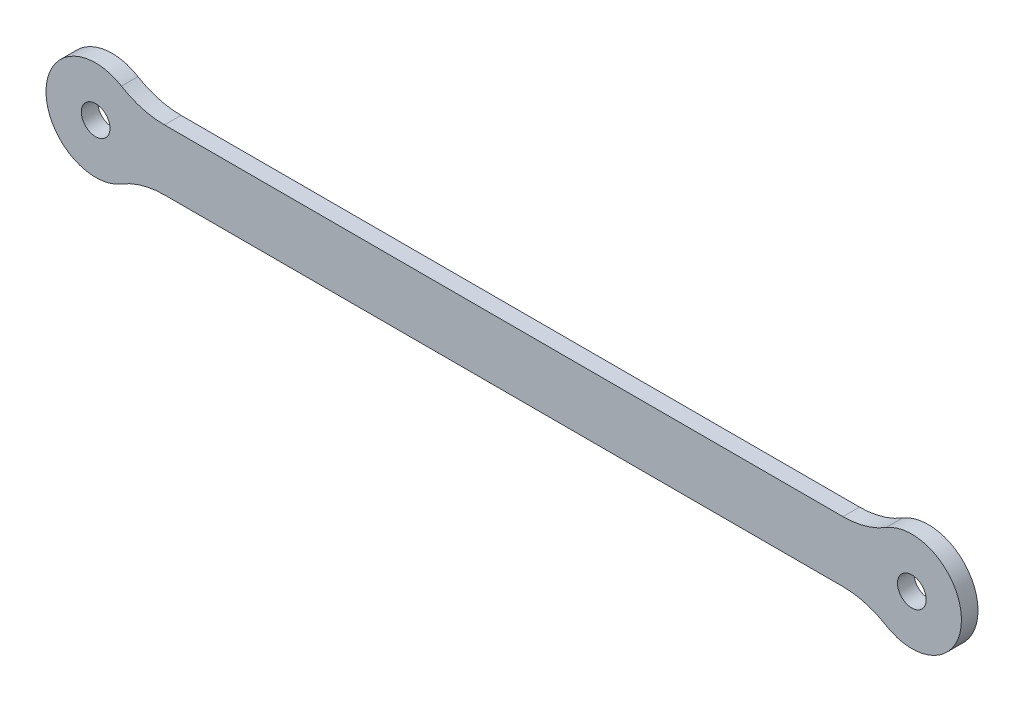
ISO-10303-21;
HEADER;
FILE_DESCRIPTION(('STEP AP214'),'2;1');
FILE_NAME('part.step','',(''),(''),'','','');
FILE_SCHEMA(('AUTOMOTIVE_DESIGN { 1 0 10303 214 1 1 1 1 }'));
ENDSEC;
DATA;
#1=APPLICATION_CONTEXT('core data for automotive mechanical design processes');
#2=APPLICATION_PROTOCOL_DEFINITION('international standard','automotive_design',2000,#1);
#3=PRODUCT_CONTEXT('',#1,'mechanical');
#4=PRODUCT('Part','Part','',(#3));
#5=PRODUCT_RELATED_PRODUCT_CATEGORY('part','',(#4));
#6=PRODUCT_DEFINITION_FORMATION('','',#4);
#7=PRODUCT_DEFINITION_CONTEXT('part definition',#1,'design');
#8=PRODUCT_DEFINITION('design','',#6,#7);
#9=PRODUCT_DEFINITION_SHAPE('','',#8);
#10=(LENGTH_UNIT() NAMED_UNIT(*) SI_UNIT(.MILLI.,.METRE.));
#11=(NAMED_UNIT(*) PLANE_ANGLE_UNIT() SI_UNIT($,.RADIAN.));
#12=(NAMED_UNIT(*) SI_UNIT($,.STERADIAN.) SOLID_ANGLE_UNIT());
#13=UNCERTAINTY_MEASURE_WITH_UNIT(LENGTH_MEASURE(1.E-05),#10,'distance_accuracy_value','');
#14=(GEOMETRIC_REPRESENTATION_CONTEXT(3) GLOBAL_UNCERTAINTY_ASSIGNED_CONTEXT((#13)) GLOBAL_UNIT_ASSIGNED_CONTEXT((#10,
#11,#12)) REPRESENTATION_CONTEXT('',''));
#15=CARTESIAN_POINT('',(0.,0.,0.));
#16=DIRECTION('',(0.,0.,1.));
#17=DIRECTION('',(1.,0.,0.));
#18=AXIS2_PLACEMENT_3D('',#15,#16,#17);
#19=CARTESIAN_POINT('',(-148.,0.,0.));
#20=DIRECTION('',(0.,0.,1.));
#21=DIRECTION('',(1.,0.,0.));
#22=AXIS2_PLACEMENT_3D('',#19,#20,#21);
#23=PLANE('',#22);
#24=CARTESIAN_POINT('',(-12.4799839743487,20.5,0.));
#25=DIRECTION('',(0.,0.,-1.));
#26=DIRECTION('',(-1.,0.,0.));
#27=AXIS2_PLACEMENT_3D('',#24,#25,#26);
#28=CIRCLE('',#27,15.);
#29=CARTESIAN_POINT('',(-12.4799839743487,5.49999999999998,0.));
#30=VERTEX_POINT('',#29);
#31=CARTESIAN_POINT('',(-4.67999399038076,7.68749999999999,0.));
#32=VERTEX_POINT('',#31);
#33=EDGE_CURVE('E43',#30,#32,#28,.F.);
#34=ORIENTED_EDGE('',*,*,#33,.T.);
#35=CARTESIAN_POINT('',(0.,0.,0.));
#36=DIRECTION('',(0.,0.,-1.));
#37=DIRECTION('',(-1.,0.,0.));
#38=AXIS2_PLACEMENT_3D('',#35,#36,#37);
#39=CIRCLE('',#38,9.);
#40=CARTESIAN_POINT('',(-4.67999399038075,-7.68750000000001,0.));
#41=VERTEX_POINT('',#40);
#42=EDGE_CURVE('E123',#41,#32,#39,.F.);
#43=ORIENTED_EDGE('',*,*,#42,.F.);
#44=CARTESIAN_POINT('',(-12.4799839743487,-20.5,0.));
#45=DIRECTION('',(0.,0.,-1.));
#46=DIRECTION('',(-1.,0.,0.));
#47=AXIS2_PLACEMENT_3D('',#44,#45,#46);
#48=CIRCLE('',#47,15.);
#49=CARTESIAN_POINT('',(-12.4799839743487,-5.50000000000002,0.));
#50=VERTEX_POINT('',#49);
#51=EDGE_CURVE('E133',#41,#50,#48,.F.);
#52=ORIENTED_EDGE('',*,*,#51,.T.);
#53=DIRECTION('',(1.,0.,0.));
#54=VECTOR('',#53,1.);
#55=CARTESIAN_POINT('',(-140.876096575612,-5.50000000000002,0.));
#56=LINE('',#55,#54);
#57=CARTESIAN_POINT('',(-135.520016025651,-5.50000000000002,0.));
#58=VERTEX_POINT('',#57);
#59=EDGE_CURVE('E137',#50,#58,#56,.F.);
#60=ORIENTED_EDGE('',*,*,#59,.T.);
#61=CARTESIAN_POINT('',(-135.520016025651,-20.5,0.));
#62=DIRECTION('',(0.,0.,-1.));
#63=DIRECTION('',(-1.,0.,0.));
#64=AXIS2_PLACEMENT_3D('',#61,#62,#63);
#65=CIRCLE('',#64,15.);
#66=CARTESIAN_POINT('',(-143.320006009619,-7.68750000000003,0.));
#67=VERTEX_POINT('',#66);
#68=EDGE_CURVE('E141',#58,#67,#65,.F.);
#69=ORIENTED_EDGE('',*,*,#68,.T.);
#70=CARTESIAN_POINT('',(-148.,0.,0.));
#71=DIRECTION('',(0.,0.,-1.));
#72=DIRECTION('',(-1.,0.,0.));
#73=AXIS2_PLACEMENT_3D('',#70,#71,#72);
#74=CIRCLE('',#73,9.00000000000001);
#75=CARTESIAN_POINT('',(-143.320006009619,7.68749999999998,0.));
#76=VERTEX_POINT('',#75);
#77=EDGE_CURVE('E144',#76,#67,#74,.F.);
#78=ORIENTED_EDGE('',*,*,#77,.F.);
#79=CARTESIAN_POINT('',(-135.520016025651,20.5,0.));
#80=DIRECTION('',(0.,0.,-1.));
#81=DIRECTION('',(-1.,0.,0.));
#82=AXIS2_PLACEMENT_3D('',#79,#80,#81);
#83=CIRCLE('',#82,15.);
#84=CARTESIAN_POINT('',(-135.520016025651,5.49999999999997,0.));
#85=VERTEX_POINT('',#84);
#86=EDGE_CURVE('E38',#76,#85,#83,.F.);
#87=ORIENTED_EDGE('',*,*,#86,.T.);
#88=DIRECTION('',(1.,0.,0.));
#89=VECTOR('',#88,1.);
#90=CARTESIAN_POINT('',(-140.876096575612,5.49999999999998,0.));
#91=LINE('',#90,#89);
#92=EDGE_CURVE('E119',#85,#30,#91,.T.);
#93=ORIENTED_EDGE('',*,*,#92,.T.);
#94=EDGE_LOOP('',(#34,#43,#52,#60,#69,#78,#87,#93));
#95=FACE_BOUND('',#94,.T.);
#96=CARTESIAN_POINT('',(-148.,0.,0.));
#97=DIRECTION('',(0.,0.,1.));
#98=DIRECTION('',(1.,0.,0.));
#99=AXIS2_PLACEMENT_3D('',#96,#97,#98);
#100=CIRCLE('',#99,2.59999999999999);
#101=CARTESIAN_POINT('',(-145.4,0.,0.));
#102=VERTEX_POINT('',#101);
#103=EDGE_CURVE('E111',#102,#102,#100,.T.);
#104=ORIENTED_EDGE('',*,*,#103,.T.);
#105=EDGE_LOOP('',(#104));
#106=FACE_BOUND('',#105,.T.);
#107=CARTESIAN_POINT('',(0.,0.,0.));
#108=DIRECTION('',(0.,0.,1.));
#109=DIRECTION('',(1.,0.,0.));
#110=AXIS2_PLACEMENT_3D('',#107,#108,#109);
#111=CIRCLE('',#110,2.6);
#112=CARTESIAN_POINT('',(2.6,0.,0.));
#113=VERTEX_POINT('',#112);
#114=EDGE_CURVE('E293',#113,#113,#111,.T.);
#115=ORIENTED_EDGE('',*,*,#114,.T.);
#116=EDGE_LOOP('',(#115));
#117=FACE_BOUND('',#116,.T.);
#118=ADVANCED_FACE('F35',(#95,#106,#117),#23,.F.);
#119=CARTESIAN_POINT('',(-140.876096575612,5.49999999999998,5.));
#120=DIRECTION('',(0.,-1.,0.));
#121=DIRECTION('',(0.,0.,-1.));
#122=AXIS2_PLACEMENT_3D('',#119,#120,#121);
#123=PLANE('',#122);
#124=DIRECTION('',(0.,0.,-1.));
#125=VECTOR('',#124,1.);
#126=CARTESIAN_POINT('',(-135.520016025651,5.49999999999997,5.));
#127=LINE('',#126,#125);
#128=CARTESIAN_POINT('',(-135.520016025651,5.49999999999996,3.));
#129=VERTEX_POINT('',#128);
#130=EDGE_CURVE('E118',#85,#129,#127,.F.);
#131=ORIENTED_EDGE('',*,*,#130,.T.);
#132=DIRECTION('',(1.,0.,0.));
#133=VECTOR('',#132,1.);
#134=CARTESIAN_POINT('',(-140.876096575612,5.49999999999998,3.));
#135=LINE('',#134,#133);
#136=CARTESIAN_POINT('',(-12.4799839743487,5.49999999999998,3.));
#137=VERTEX_POINT('',#136);
#138=EDGE_CURVE('E89',#129,#137,#135,.T.);
#139=ORIENTED_EDGE('',*,*,#138,.T.);
#140=DIRECTION('',(0.,0.,-1.));
#141=VECTOR('',#140,1.);
#142=CARTESIAN_POINT('',(-12.4799839743487,5.49999999999998,5.));
#143=LINE('',#142,#141);
#144=EDGE_CURVE('E116',#137,#30,#143,.T.);
#145=ORIENTED_EDGE('',*,*,#144,.T.);
#146=ORIENTED_EDGE('',*,*,#92,.F.);
#147=EDGE_LOOP('',(#131,#139,#145,#146));
#148=FACE_BOUND('',#147,.T.);
#149=ADVANCED_FACE('F115',(#148),#123,.F.);
#150=CARTESIAN_POINT('',(-135.520016025651,20.5,5.));
#151=DIRECTION('',(0.,0.,-1.));
#152=DIRECTION('',(-1.,0.,0.));
#153=AXIS2_PLACEMENT_3D('',#150,#151,#152);
#154=CYLINDRICAL_SURFACE('',#153,15.);
#155=DIRECTION('',(0.,0.,-1.));
#156=VECTOR('',#155,1.);
#157=CARTESIAN_POINT('',(-143.320006009619,7.68749999999998,5.));
#158=LINE('',#157,#156);
#159=CARTESIAN_POINT('',(-143.320006009619,7.68749999999998,3.));
#160=VERTEX_POINT('',#159);
#161=EDGE_CURVE('E142',#160,#76,#158,.T.);
#162=ORIENTED_EDGE('',*,*,#161,.F.);
#163=CARTESIAN_POINT('',(-135.520016025651,20.5,3.));
#164=DIRECTION('',(0.,0.,-1.));
#165=DIRECTION('',(-1.,0.,0.));
#166=AXIS2_PLACEMENT_3D('',#163,#164,#165);
#167=CIRCLE('',#166,15.);
#168=EDGE_CURVE('E120',#160,#129,#167,.F.);
#169=ORIENTED_EDGE('',*,*,#168,.T.);
#170=ORIENTED_EDGE('',*,*,#130,.F.);
#171=ORIENTED_EDGE('',*,*,#86,.F.);
#172=EDGE_LOOP('',(#162,#169,#170,#171));
#173=FACE_BOUND('',#172,.T.);
#174=ADVANCED_FACE('F171',(#173),#154,.F.);
#175=CARTESIAN_POINT('',(-148.,0.,5.));
#176=DIRECTION('',(0.,0.,-1.));
#177=DIRECTION('',(-1.,0.,0.));
#178=AXIS2_PLACEMENT_3D('',#175,#176,#177);
#179=CYLINDRICAL_SURFACE('',#178,9.00000000000001);
#180=CARTESIAN_POINT('',(-148.,0.,3.));
#181=DIRECTION('',(0.,0.,-1.));
#182=DIRECTION('',(-1.,0.,0.));
#183=AXIS2_PLACEMENT_3D('',#180,#181,#182);
#184=CIRCLE('',#183,9.00000000000001);
#185=CARTESIAN_POINT('',(-143.320006009619,-7.68750000000002,3.));
#186=VERTEX_POINT('',#185);
#187=EDGE_CURVE('E162',#160,#186,#184,.F.);
#188=ORIENTED_EDGE('',*,*,#187,.F.);
#189=ORIENTED_EDGE('',*,*,#161,.T.);
#190=ORIENTED_EDGE('',*,*,#77,.T.);
#191=DIRECTION('',(0.,0.,-1.));
#192=VECTOR('',#191,1.);
#193=CARTESIAN_POINT('',(-143.320006009619,-7.68750000000003,5.));
#194=LINE('',#193,#192);
#195=EDGE_CURVE('E138',#67,#186,#194,.F.);
#196=ORIENTED_EDGE('',*,*,#195,.T.);
#197=EDGE_LOOP('',(#188,#189,#190,#196));
#198=FACE_BOUND('',#197,.T.);
#199=ADVANCED_FACE('F153',(#198),#179,.T.);
#200=CARTESIAN_POINT('',(-135.520016025651,-20.5,5.));
#201=DIRECTION('',(0.,0.,-1.));
#202=DIRECTION('',(-1.,0.,0.));
#203=AXIS2_PLACEMENT_3D('',#200,#201,#202);
#204=CYLINDRICAL_SURFACE('',#203,15.);
#205=DIRECTION('',(0.,0.,1.));
#206=VECTOR('',#205,1.);
#207=CARTESIAN_POINT('',(-135.520016025651,-5.50000000000002,5.));
#208=LINE('',#207,#206);
#209=CARTESIAN_POINT('',(-135.520016025651,-5.50000000000002,3.));
#210=VERTEX_POINT('',#209);
#211=EDGE_CURVE('E134',#58,#210,#208,.T.);
#212=ORIENTED_EDGE('',*,*,#211,.T.);
#213=CARTESIAN_POINT('',(-135.520016025651,-20.5,3.));
#214=DIRECTION('',(0.,0.,-1.));
#215=DIRECTION('',(-1.,0.,0.));
#216=AXIS2_PLACEMENT_3D('',#213,#214,#215);
#217=CIRCLE('',#216,15.);
#218=EDGE_CURVE('E160',#210,#186,#217,.F.);
#219=ORIENTED_EDGE('',*,*,#218,.T.);
#220=ORIENTED_EDGE('',*,*,#195,.F.);
#221=ORIENTED_EDGE('',*,*,#68,.F.);
#222=EDGE_LOOP('',(#212,#219,#220,#221));
#223=FACE_BOUND('',#222,.T.);
#224=ADVANCED_FACE('F158',(#223),#204,.F.);
#225=CARTESIAN_POINT('',(-140.876096575612,-5.50000000000002,5.));
#226=DIRECTION('',(0.,1.,0.));
#227=DIRECTION('',(0.,0.,1.));
#228=AXIS2_PLACEMENT_3D('',#225,#226,#227);
#229=PLANE('',#228);
#230=DIRECTION('',(0.,0.,-1.));
#231=VECTOR('',#230,1.);
#232=CARTESIAN_POINT('',(-12.4799839743487,-5.50000000000002,5.));
#233=LINE('',#232,#231);
#234=CARTESIAN_POINT('',(-12.4799839743487,-5.50000000000001,3.));
#235=VERTEX_POINT('',#234);
#236=EDGE_CURVE('E130',#50,#235,#233,.F.);
#237=ORIENTED_EDGE('',*,*,#236,.T.);
#238=DIRECTION('',(-1.,0.,0.));
#239=VECTOR('',#238,1.);
#240=CARTESIAN_POINT('',(-140.876096575612,-5.50000000000002,3.));
#241=LINE('',#240,#239);
#242=EDGE_CURVE('E163',#235,#210,#241,.T.);
#243=ORIENTED_EDGE('',*,*,#242,.T.);
#244=ORIENTED_EDGE('',*,*,#211,.F.);
#245=ORIENTED_EDGE('',*,*,#59,.F.);
#246=EDGE_LOOP('',(#237,#243,#244,#245));
#247=FACE_BOUND('',#246,.T.);
#248=ADVANCED_FACE('F196',(#247),#229,.F.);
#249=CARTESIAN_POINT('',(-12.4799839743487,-20.5,5.));
#250=DIRECTION('',(0.,0.,-1.));
#251=DIRECTION('',(-1.,0.,0.));
#252=AXIS2_PLACEMENT_3D('',#249,#250,#251);
#253=CYLINDRICAL_SURFACE('',#252,15.);
#254=DIRECTION('',(0.,0.,-1.));
#255=VECTOR('',#254,1.);
#256=CARTESIAN_POINT('',(-4.67999399038075,-7.68750000000001,5.));
#257=LINE('',#256,#255);
#258=CARTESIAN_POINT('',(-4.67999399038075,-7.68750000000001,3.));
#259=VERTEX_POINT('',#258);
#260=EDGE_CURVE('E126',#259,#41,#257,.T.);
#261=ORIENTED_EDGE('',*,*,#260,.F.);
#262=CARTESIAN_POINT('',(-12.4799839743487,-20.5,3.));
#263=DIRECTION('',(0.,0.,-1.));
#264=DIRECTION('',(-1.,0.,0.));
#265=AXIS2_PLACEMENT_3D('',#262,#263,#264);
#266=CIRCLE('',#265,15.);
#267=EDGE_CURVE('E166',#259,#235,#266,.F.);
#268=ORIENTED_EDGE('',*,*,#267,.T.);
#269=ORIENTED_EDGE('',*,*,#236,.F.);
#270=ORIENTED_EDGE('',*,*,#51,.F.);
#271=EDGE_LOOP('',(#261,#268,#269,#270));
#272=FACE_BOUND('',#271,.T.);
#273=ADVANCED_FACE('F189',(#272),#253,.F.);
#274=CARTESIAN_POINT('',(0.,0.,5.));
#275=DIRECTION('',(0.,0.,-1.));
#276=DIRECTION('',(-1.,0.,0.));
#277=AXIS2_PLACEMENT_3D('',#274,#275,#276);
#278=CYLINDRICAL_SURFACE('',#277,9.);
#279=CARTESIAN_POINT('',(0.,0.,3.));
#280=DIRECTION('',(0.,0.,-1.));
#281=DIRECTION('',(-1.,0.,0.));
#282=AXIS2_PLACEMENT_3D('',#279,#280,#281);
#283=CIRCLE('',#282,9.);
#284=CARTESIAN_POINT('',(-4.67999399038076,7.6875,3.));
#285=VERTEX_POINT('',#284);
#286=EDGE_CURVE('E51',#259,#285,#283,.F.);
#287=ORIENTED_EDGE('',*,*,#286,.F.);
#288=ORIENTED_EDGE('',*,*,#260,.T.);
#289=ORIENTED_EDGE('',*,*,#42,.T.);
#290=DIRECTION('',(0.,0.,-1.));
#291=VECTOR('',#290,1.);
#292=CARTESIAN_POINT('',(-4.67999399038076,7.6875,5.));
#293=LINE('',#292,#291);
#294=EDGE_CURVE('E11',#32,#285,#293,.F.);
#295=ORIENTED_EDGE('',*,*,#294,.T.);
#296=EDGE_LOOP('',(#287,#288,#289,#295));
#297=FACE_BOUND('',#296,.T.);
#298=ADVANCED_FACE('F180',(#297),#278,.T.);
#299=CARTESIAN_POINT('',(-12.4799839743487,20.5,5.));
#300=DIRECTION('',(0.,0.,-1.));
#301=DIRECTION('',(-1.,0.,0.));
#302=AXIS2_PLACEMENT_3D('',#299,#300,#301);
#303=CYLINDRICAL_SURFACE('',#302,15.);
#304=ORIENTED_EDGE('',*,*,#144,.F.);
#305=CARTESIAN_POINT('',(-12.4799839743487,20.5,3.));
#306=DIRECTION('',(0.,0.,-1.));
#307=DIRECTION('',(-1.,0.,0.));
#308=AXIS2_PLACEMENT_3D('',#305,#306,#307);
#309=CIRCLE('',#308,15.);
#310=EDGE_CURVE('E105',#137,#285,#309,.F.);
#311=ORIENTED_EDGE('',*,*,#310,.T.);
#312=ORIENTED_EDGE('',*,*,#294,.F.);
#313=ORIENTED_EDGE('',*,*,#33,.F.);
#314=EDGE_LOOP('',(#304,#311,#312,#313));
#315=FACE_BOUND('',#314,.T.);
#316=ADVANCED_FACE('F122',(#315),#303,.F.);
#317=CARTESIAN_POINT('',(0.,0.,3.));
#318=DIRECTION('',(0.,0.,-1.));
#319=DIRECTION('',(-1.,0.,0.));
#320=AXIS2_PLACEMENT_3D('',#317,#318,#319);
#321=PLANE('',#320);
#322=ORIENTED_EDGE('',*,*,#267,.F.);
#323=ORIENTED_EDGE('',*,*,#286,.T.);
#324=ORIENTED_EDGE('',*,*,#310,.F.);
#325=ORIENTED_EDGE('',*,*,#138,.F.);
#326=ORIENTED_EDGE('',*,*,#168,.F.);
#327=ORIENTED_EDGE('',*,*,#187,.T.);
#328=ORIENTED_EDGE('',*,*,#218,.F.);
#329=ORIENTED_EDGE('',*,*,#242,.F.);
#330=EDGE_LOOP('',(#322,#323,#324,#325,#326,#327,#328,#329));
#331=FACE_BOUND('',#330,.T.);
#332=CARTESIAN_POINT('',(-148.,0.,3.));
#333=DIRECTION('',(0.,0.,1.));
#334=DIRECTION('',(1.,0.,0.));
#335=AXIS2_PLACEMENT_3D('',#332,#333,#334);
#336=CIRCLE('',#335,2.59999999999999);
#337=CARTESIAN_POINT('',(-145.4,0.,3.));
#338=VERTEX_POINT('',#337);
#339=EDGE_CURVE('E299',#338,#338,#336,.T.);
#340=ORIENTED_EDGE('',*,*,#339,.F.);
#341=EDGE_LOOP('',(#340));
#342=FACE_BOUND('',#341,.T.);
#343=CARTESIAN_POINT('',(0.,0.,3.));
#344=DIRECTION('',(0.,0.,1.));
#345=DIRECTION('',(1.,0.,0.));
#346=AXIS2_PLACEMENT_3D('',#343,#344,#345);
#347=CIRCLE('',#346,2.6);
#348=CARTESIAN_POINT('',(2.6,0.,3.));
#349=VERTEX_POINT('',#348);
#350=EDGE_CURVE('E296',#349,#349,#347,.T.);
#351=ORIENTED_EDGE('',*,*,#350,.F.);
#352=EDGE_LOOP('',(#351));
#353=FACE_BOUND('',#352,.T.);
#354=ADVANCED_FACE('F106',(#331,#342,#353),#321,.F.);
#355=CARTESIAN_POINT('',(-148.,0.,0.));
#356=DIRECTION('',(0.,0.,1.));
#357=DIRECTION('',(1.,0.,0.));
#358=AXIS2_PLACEMENT_3D('',#355,#356,#357);
#359=CYLINDRICAL_SURFACE('',#358,2.59999999999999);
#360=ORIENTED_EDGE('',*,*,#103,.F.);
#361=EDGE_LOOP('',(#360));
#362=FACE_BOUND('',#361,.T.);
#363=ORIENTED_EDGE('',*,*,#339,.T.);
#364=EDGE_LOOP('',(#363));
#365=FACE_BOUND('',#364,.T.);
#366=ADVANCED_FACE('F187',(#362,#365),#359,.F.);
#367=CARTESIAN_POINT('',(0.,0.,0.));
#368=DIRECTION('',(0.,0.,1.));
#369=DIRECTION('',(1.,0.,0.));
#370=AXIS2_PLACEMENT_3D('',#367,#368,#369);
#371=CYLINDRICAL_SURFACE('',#370,2.6);
#372=ORIENTED_EDGE('',*,*,#114,.F.);
#373=EDGE_LOOP('',(#372));
#374=FACE_BOUND('',#373,.T.);
#375=ORIENTED_EDGE('',*,*,#350,.T.);
#376=EDGE_LOOP('',(#375));
#377=FACE_BOUND('',#376,.T.);
#378=ADVANCED_FACE('F274',(#374,#377),#371,.F.);
#379=CLOSED_SHELL('',(#118,#149,#174,#199,#224,#248,#273,#298,#316,#354,#366,#378));
#380=MANIFOLD_SOLID_BREP('B2',#379);
#381=ADVANCED_BREP_SHAPE_REPRESENTATION('',(#18,#380),#14);
#382=SHAPE_DEFINITION_REPRESENTATION(#9,#381);
ENDSEC;
END-ISO-10303-21;
